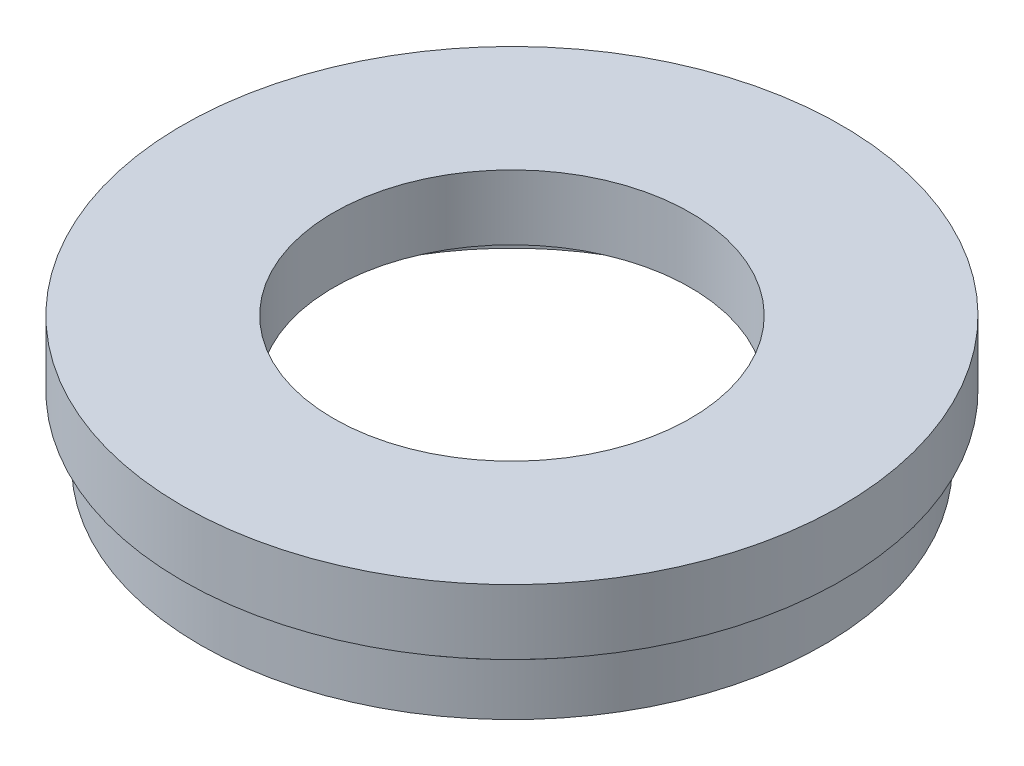
ISO-10303-21;
HEADER;
FILE_DESCRIPTION(('STEP AP214'),'2;1');
FILE_NAME('part.step','',(''),(''),'','','');
FILE_SCHEMA(('AUTOMOTIVE_DESIGN { 1 0 10303 214 1 1 1 1 }'));
ENDSEC;
DATA;
#1=APPLICATION_CONTEXT('core data for automotive mechanical design processes');
#2=APPLICATION_PROTOCOL_DEFINITION('international standard','automotive_design',2000,#1);
#3=PRODUCT_CONTEXT('',#1,'mechanical');
#4=PRODUCT('Part','Part','',(#3));
#5=PRODUCT_RELATED_PRODUCT_CATEGORY('part','',(#4));
#6=PRODUCT_DEFINITION_FORMATION('','',#4);
#7=PRODUCT_DEFINITION_CONTEXT('part definition',#1,'design');
#8=PRODUCT_DEFINITION('design','',#6,#7);
#9=PRODUCT_DEFINITION_SHAPE('','',#8);
#10=(LENGTH_UNIT() NAMED_UNIT(*) SI_UNIT(.MILLI.,.METRE.));
#11=(NAMED_UNIT(*) PLANE_ANGLE_UNIT() SI_UNIT($,.RADIAN.));
#12=(NAMED_UNIT(*) SI_UNIT($,.STERADIAN.) SOLID_ANGLE_UNIT());
#13=UNCERTAINTY_MEASURE_WITH_UNIT(LENGTH_MEASURE(1.E-05),#10,'distance_accuracy_value','');
#14=(GEOMETRIC_REPRESENTATION_CONTEXT(3) GLOBAL_UNCERTAINTY_ASSIGNED_CONTEXT((#13)) GLOBAL_UNIT_ASSIGNED_CONTEXT((#10,
#11,#12)) REPRESENTATION_CONTEXT('',''));
#15=CARTESIAN_POINT('',(0.,0.,0.));
#16=DIRECTION('',(0.,0.,1.));
#17=DIRECTION('',(1.,0.,0.));
#18=AXIS2_PLACEMENT_3D('',#15,#16,#17);
#19=CARTESIAN_POINT('',(20.5,0.,0.));
#20=DIRECTION('',(0.,1.,0.));
#21=DIRECTION('',(0.,0.,1.));
#22=AXIS2_PLACEMENT_3D('',#19,#20,#21);
#23=PLANE('',#22);
#24=CARTESIAN_POINT('',(0.,0.,0.));
#25=DIRECTION('',(0.,1.,0.));
#26=DIRECTION('',(0.,0.,1.));
#27=AXIS2_PLACEMENT_3D('',#24,#25,#26);
#28=CIRCLE('',#27,24.);
#29=CARTESIAN_POINT('',(0.,0.,24.));
#30=VERTEX_POINT('',#29);
#31=EDGE_CURVE('E10',#30,#30,#28,.T.);
#32=ORIENTED_EDGE('',*,*,#31,.F.);
#33=EDGE_LOOP('',(#32));
#34=FACE_BOUND('',#33,.T.);
#35=CARTESIAN_POINT('',(0.,0.,0.));
#36=DIRECTION('',(0.,1.,0.));
#37=DIRECTION('',(0.,0.,1.));
#38=AXIS2_PLACEMENT_3D('',#35,#36,#37);
#39=CIRCLE('',#38,20.5);
#40=CARTESIAN_POINT('',(0.,0.,20.5));
#41=VERTEX_POINT('',#40);
#42=EDGE_CURVE('E75',#41,#41,#39,.T.);
#43=ORIENTED_EDGE('',*,*,#42,.T.);
#44=EDGE_LOOP('',(#43));
#45=FACE_BOUND('',#44,.T.);
#46=ADVANCED_FACE('F35',(#34,#45),#23,.F.);
#47=CARTESIAN_POINT('',(0.,17.4192983181939,0.));
#48=DIRECTION('',(0.,1.,0.));
#49=DIRECTION('',(0.,0.,1.));
#50=AXIS2_PLACEMENT_3D('',#47,#48,#49);
#51=CYLINDRICAL_SURFACE('',#50,24.);
#52=CARTESIAN_POINT('',(0.,4.,0.));
#53=DIRECTION('',(0.,1.,0.));
#54=DIRECTION('',(0.,0.,1.));
#55=AXIS2_PLACEMENT_3D('',#52,#53,#54);
#56=CIRCLE('',#55,24.);
#57=CARTESIAN_POINT('',(0.,4.,24.));
#58=VERTEX_POINT('',#57);
#59=EDGE_CURVE('E41',#58,#58,#56,.T.);
#60=ORIENTED_EDGE('',*,*,#59,.F.);
#61=EDGE_LOOP('',(#60));
#62=FACE_BOUND('',#61,.T.);
#63=ORIENTED_EDGE('',*,*,#31,.T.);
#64=EDGE_LOOP('',(#63));
#65=FACE_BOUND('',#64,.T.);
#66=ADVANCED_FACE('F136',(#62,#65),#51,.T.);
#67=CARTESIAN_POINT('',(24.,4.,0.));
#68=DIRECTION('',(0.,-1.,0.));
#69=DIRECTION('',(0.,0.,-1.));
#70=AXIS2_PLACEMENT_3D('',#67,#68,#69);
#71=PLANE('',#70);
#72=CARTESIAN_POINT('',(0.,4.,0.));
#73=DIRECTION('',(0.,1.,0.));
#74=DIRECTION('',(0.,0.,1.));
#75=AXIS2_PLACEMENT_3D('',#72,#73,#74);
#76=CIRCLE('',#75,23.5);
#77=CARTESIAN_POINT('',(0.,4.,23.5));
#78=VERTEX_POINT('',#77);
#79=EDGE_CURVE('E45',#78,#78,#76,.T.);
#80=ORIENTED_EDGE('',*,*,#79,.F.);
#81=EDGE_LOOP('',(#80));
#82=FACE_BOUND('',#81,.T.);
#83=ORIENTED_EDGE('',*,*,#59,.T.);
#84=EDGE_LOOP('',(#83));
#85=FACE_BOUND('',#84,.T.);
#86=ADVANCED_FACE('F131',(#82,#85),#71,.F.);
#87=CARTESIAN_POINT('',(0.,17.4192983181939,0.));
#88=DIRECTION('',(0.,1.,0.));
#89=DIRECTION('',(0.,0.,1.));
#90=AXIS2_PLACEMENT_3D('',#87,#88,#89);
#91=CYLINDRICAL_SURFACE('',#90,23.5);
#92=CARTESIAN_POINT('',(0.,5.,0.));
#93=DIRECTION('',(0.,1.,0.));
#94=DIRECTION('',(0.,0.,1.));
#95=AXIS2_PLACEMENT_3D('',#92,#93,#94);
#96=CIRCLE('',#95,23.5);
#97=CARTESIAN_POINT('',(0.,5.,23.5));
#98=VERTEX_POINT('',#97);
#99=EDGE_CURVE('E49',#98,#98,#96,.T.);
#100=ORIENTED_EDGE('',*,*,#99,.F.);
#101=EDGE_LOOP('',(#100));
#102=FACE_BOUND('',#101,.T.);
#103=ORIENTED_EDGE('',*,*,#79,.T.);
#104=EDGE_LOOP('',(#103));
#105=FACE_BOUND('',#104,.T.);
#106=ADVANCED_FACE('F125',(#102,#105),#91,.T.);
#107=CARTESIAN_POINT('',(23.5,5.,0.));
#108=DIRECTION('',(0.,1.,0.));
#109=DIRECTION('',(0.,0.,1.));
#110=AXIS2_PLACEMENT_3D('',#107,#108,#109);
#111=PLANE('',#110);
#112=CARTESIAN_POINT('',(0.,5.,0.));
#113=DIRECTION('',(0.,1.,0.));
#114=DIRECTION('',(0.,0.,1.));
#115=AXIS2_PLACEMENT_3D('',#112,#113,#114);
#116=CIRCLE('',#115,25.4);
#117=CARTESIAN_POINT('',(0.,5.,25.4));
#118=VERTEX_POINT('',#117);
#119=EDGE_CURVE('E54',#118,#118,#116,.T.);
#120=ORIENTED_EDGE('',*,*,#119,.F.);
#121=EDGE_LOOP('',(#120));
#122=FACE_BOUND('',#121,.T.);
#123=ORIENTED_EDGE('',*,*,#99,.T.);
#124=EDGE_LOOP('',(#123));
#125=FACE_BOUND('',#124,.T.);
#126=ADVANCED_FACE('F119',(#122,#125),#111,.F.);
#127=CARTESIAN_POINT('',(0.,17.4192983181939,0.));
#128=DIRECTION('',(0.,1.,0.));
#129=DIRECTION('',(0.,0.,1.));
#130=AXIS2_PLACEMENT_3D('',#127,#128,#129);
#131=CYLINDRICAL_SURFACE('',#130,25.4);
#132=CARTESIAN_POINT('',(0.,10.,0.));
#133=DIRECTION('',(0.,1.,0.));
#134=DIRECTION('',(0.,0.,1.));
#135=AXIS2_PLACEMENT_3D('',#132,#133,#134);
#136=CIRCLE('',#135,25.4);
#137=CARTESIAN_POINT('',(0.,10.,25.4));
#138=VERTEX_POINT('',#137);
#139=EDGE_CURVE('E57',#138,#138,#136,.T.);
#140=ORIENTED_EDGE('',*,*,#139,.F.);
#141=EDGE_LOOP('',(#140));
#142=FACE_BOUND('',#141,.T.);
#143=ORIENTED_EDGE('',*,*,#119,.T.);
#144=EDGE_LOOP('',(#143));
#145=FACE_BOUND('',#144,.T.);
#146=ADVANCED_FACE('F113',(#142,#145),#131,.T.);
#147=CARTESIAN_POINT('',(13.75,10.,0.));
#148=DIRECTION('',(0.,-1.,0.));
#149=DIRECTION('',(0.,0.,-1.));
#150=AXIS2_PLACEMENT_3D('',#147,#148,#149);
#151=PLANE('',#150);
#152=CARTESIAN_POINT('',(0.,10.,0.));
#153=DIRECTION('',(0.,1.,0.));
#154=DIRECTION('',(0.,0.,1.));
#155=AXIS2_PLACEMENT_3D('',#152,#153,#154);
#156=CIRCLE('',#155,13.75);
#157=CARTESIAN_POINT('',(0.,10.,13.75));
#158=VERTEX_POINT('',#157);
#159=EDGE_CURVE('E60',#158,#158,#156,.T.);
#160=ORIENTED_EDGE('',*,*,#159,.F.);
#161=EDGE_LOOP('',(#160));
#162=FACE_BOUND('',#161,.T.);
#163=ORIENTED_EDGE('',*,*,#139,.T.);
#164=EDGE_LOOP('',(#163));
#165=FACE_BOUND('',#164,.T.);
#166=ADVANCED_FACE('F107',(#162,#165),#151,.F.);
#167=CARTESIAN_POINT('',(0.,17.4192983181939,0.));
#168=DIRECTION('',(0.,1.,0.));
#169=DIRECTION('',(0.,0.,1.));
#170=AXIS2_PLACEMENT_3D('',#167,#168,#169);
#171=CYLINDRICAL_SURFACE('',#170,13.75);
#172=CARTESIAN_POINT('',(0.,5.,0.));
#173=DIRECTION('',(0.,1.,0.));
#174=DIRECTION('',(0.,0.,1.));
#175=AXIS2_PLACEMENT_3D('',#172,#173,#174);
#176=CIRCLE('',#175,13.75);
#177=CARTESIAN_POINT('',(0.,5.,13.75));
#178=VERTEX_POINT('',#177);
#179=EDGE_CURVE('E63',#178,#178,#176,.T.);
#180=ORIENTED_EDGE('',*,*,#179,.F.);
#181=EDGE_LOOP('',(#180));
#182=FACE_BOUND('',#181,.T.);
#183=ORIENTED_EDGE('',*,*,#159,.T.);
#184=EDGE_LOOP('',(#183));
#185=FACE_BOUND('',#184,.T.);
#186=ADVANCED_FACE('F101',(#182,#185),#171,.F.);
#187=CARTESIAN_POINT('',(21.1,5.,0.));
#188=DIRECTION('',(0.,1.,0.));
#189=DIRECTION('',(0.,0.,1.));
#190=AXIS2_PLACEMENT_3D('',#187,#188,#189);
#191=PLANE('',#190);
#192=CARTESIAN_POINT('',(0.,5.,0.));
#193=DIRECTION('',(0.,1.,0.));
#194=DIRECTION('',(0.,0.,1.));
#195=AXIS2_PLACEMENT_3D('',#192,#193,#194);
#196=CIRCLE('',#195,21.1);
#197=CARTESIAN_POINT('',(0.,5.,21.1));
#198=VERTEX_POINT('',#197);
#199=EDGE_CURVE('E66',#198,#198,#196,.T.);
#200=ORIENTED_EDGE('',*,*,#199,.F.);
#201=EDGE_LOOP('',(#200));
#202=FACE_BOUND('',#201,.T.);
#203=ORIENTED_EDGE('',*,*,#179,.T.);
#204=EDGE_LOOP('',(#203));
#205=FACE_BOUND('',#204,.T.);
#206=ADVANCED_FACE('F95',(#202,#205),#191,.F.);
#207=CARTESIAN_POINT('',(0.,17.4192983181939,0.));
#208=DIRECTION('',(0.,1.,0.));
#209=DIRECTION('',(0.,0.,1.));
#210=AXIS2_PLACEMENT_3D('',#207,#208,#209);
#211=CYLINDRICAL_SURFACE('',#210,21.1);
#212=CARTESIAN_POINT('',(0.,4.,0.));
#213=DIRECTION('',(0.,1.,0.));
#214=DIRECTION('',(0.,0.,1.));
#215=AXIS2_PLACEMENT_3D('',#212,#213,#214);
#216=CIRCLE('',#215,21.1);
#217=CARTESIAN_POINT('',(0.,4.,21.1));
#218=VERTEX_POINT('',#217);
#219=EDGE_CURVE('E69',#218,#218,#216,.T.);
#220=ORIENTED_EDGE('',*,*,#219,.F.);
#221=EDGE_LOOP('',(#220));
#222=FACE_BOUND('',#221,.T.);
#223=ORIENTED_EDGE('',*,*,#199,.T.);
#224=EDGE_LOOP('',(#223));
#225=FACE_BOUND('',#224,.T.);
#226=ADVANCED_FACE('F89',(#222,#225),#211,.F.);
#227=CARTESIAN_POINT('',(20.5,4.,0.));
#228=DIRECTION('',(0.,-1.,0.));
#229=DIRECTION('',(0.,0.,-1.));
#230=AXIS2_PLACEMENT_3D('',#227,#228,#229);
#231=PLANE('',#230);
#232=CARTESIAN_POINT('',(0.,4.,0.));
#233=DIRECTION('',(0.,1.,0.));
#234=DIRECTION('',(0.,0.,1.));
#235=AXIS2_PLACEMENT_3D('',#232,#233,#234);
#236=CIRCLE('',#235,20.5);
#237=CARTESIAN_POINT('',(0.,4.,20.5));
#238=VERTEX_POINT('',#237);
#239=EDGE_CURVE('E72',#238,#238,#236,.T.);
#240=ORIENTED_EDGE('',*,*,#239,.F.);
#241=EDGE_LOOP('',(#240));
#242=FACE_BOUND('',#241,.T.);
#243=ORIENTED_EDGE('',*,*,#219,.T.);
#244=EDGE_LOOP('',(#243));
#245=FACE_BOUND('',#244,.T.);
#246=ADVANCED_FACE('F83',(#242,#245),#231,.F.);
#247=CARTESIAN_POINT('',(0.,17.4192983181939,0.));
#248=DIRECTION('',(0.,1.,0.));
#249=DIRECTION('',(0.,0.,1.));
#250=AXIS2_PLACEMENT_3D('',#247,#248,#249);
#251=CYLINDRICAL_SURFACE('',#250,20.5);
#252=ORIENTED_EDGE('',*,*,#42,.F.);
#253=EDGE_LOOP('',(#252));
#254=FACE_BOUND('',#253,.T.);
#255=ORIENTED_EDGE('',*,*,#239,.T.);
#256=EDGE_LOOP('',(#255));
#257=FACE_BOUND('',#256,.T.);
#258=ADVANCED_FACE('F80',(#254,#257),#251,.F.);
#259=CLOSED_SHELL('',(#46,#66,#86,#106,#126,#146,#166,#186,#206,#226,#246,#258));
#260=MANIFOLD_SOLID_BREP('B2',#259);
#261=ADVANCED_BREP_SHAPE_REPRESENTATION('',(#18,#260),#14);
#262=SHAPE_DEFINITION_REPRESENTATION(#9,#261);
ENDSEC;
END-ISO-10303-21;
